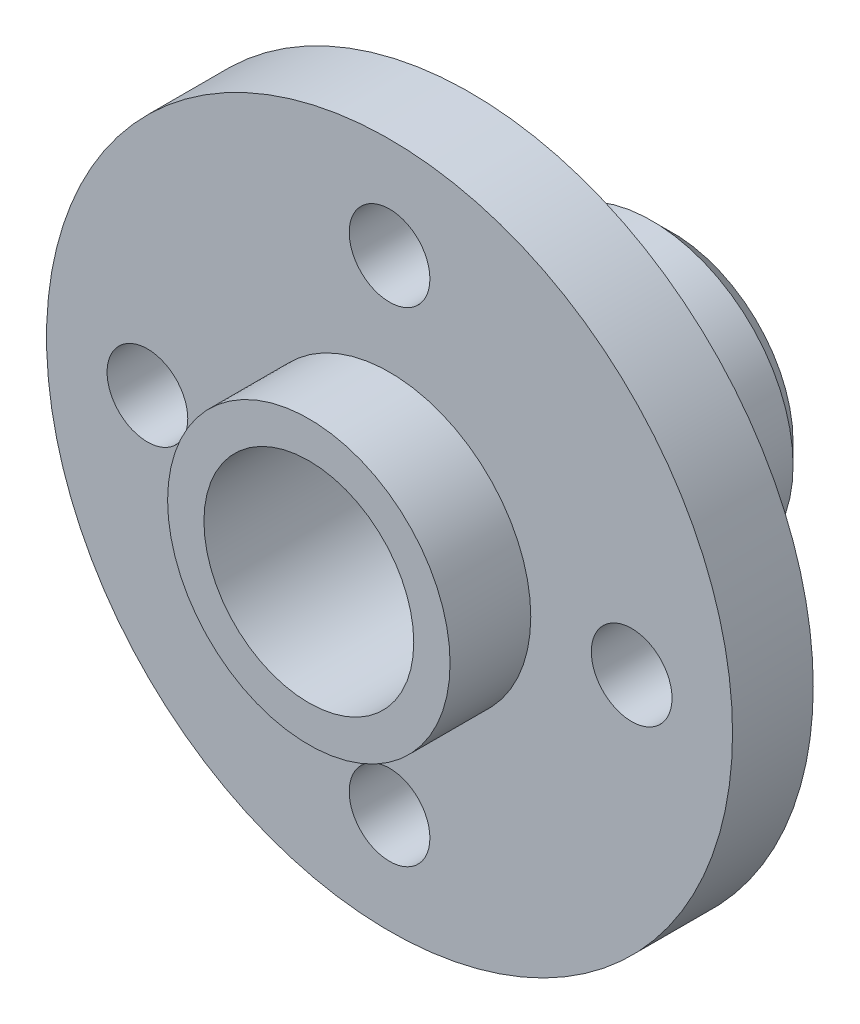
ISO-10303-21;
HEADER;
FILE_DESCRIPTION(('STEP AP214'),'2;1');
FILE_NAME('part.step','',(''),(''),'','','');
FILE_SCHEMA(('AUTOMOTIVE_DESIGN { 1 0 10303 214 1 1 1 1 }'));
ENDSEC;
DATA;
#1=APPLICATION_CONTEXT('core data for automotive mechanical design processes');
#2=APPLICATION_PROTOCOL_DEFINITION('international standard','automotive_design',2000,#1);
#3=PRODUCT_CONTEXT('',#1,'mechanical');
#4=PRODUCT('Part','Part','',(#3));
#5=PRODUCT_RELATED_PRODUCT_CATEGORY('part','',(#4));
#6=PRODUCT_DEFINITION_FORMATION('','',#4);
#7=PRODUCT_DEFINITION_CONTEXT('part definition',#1,'design');
#8=PRODUCT_DEFINITION('design','',#6,#7);
#9=PRODUCT_DEFINITION_SHAPE('','',#8);
#10=(LENGTH_UNIT() NAMED_UNIT(*) SI_UNIT(.MILLI.,.METRE.));
#11=(NAMED_UNIT(*) PLANE_ANGLE_UNIT() SI_UNIT($,.RADIAN.));
#12=(NAMED_UNIT(*) SI_UNIT($,.STERADIAN.) SOLID_ANGLE_UNIT());
#13=UNCERTAINTY_MEASURE_WITH_UNIT(LENGTH_MEASURE(1.E-05),#10,'distance_accuracy_value','');
#14=(GEOMETRIC_REPRESENTATION_CONTEXT(3) GLOBAL_UNCERTAINTY_ASSIGNED_CONTEXT((#13)) GLOBAL_UNIT_ASSIGNED_CONTEXT((#10,
#11,#12)) REPRESENTATION_CONTEXT('',''));
#15=CARTESIAN_POINT('',(0.,0.,0.));
#16=DIRECTION('',(0.,0.,1.));
#17=DIRECTION('',(1.,0.,0.));
#18=AXIS2_PLACEMENT_3D('',#15,#16,#17);
#19=CARTESIAN_POINT('',(0.,0.,0.));
#20=DIRECTION('',(0.,0.,1.));
#21=DIRECTION('',(1.,0.,0.));
#22=AXIS2_PLACEMENT_3D('',#19,#20,#21);
#23=PLANE('',#22);
#24=CARTESIAN_POINT('',(0.,-6.,0.));
#25=DIRECTION('',(0.,0.,1.));
#26=DIRECTION('',(1.,0.,0.));
#27=AXIS2_PLACEMENT_3D('',#24,#25,#26);
#28=CIRCLE('',#27,1.);
#29=CARTESIAN_POINT('',(1.,-6.,0.));
#30=VERTEX_POINT('',#29);
#31=EDGE_CURVE('E77',#30,#30,#28,.T.);
#32=ORIENTED_EDGE('',*,*,#31,.T.);
#33=EDGE_LOOP('',(#32));
#34=FACE_BOUND('',#33,.T.);
#35=CARTESIAN_POINT('',(6.,0.,0.));
#36=DIRECTION('',(0.,0.,1.));
#37=DIRECTION('',(1.,0.,0.));
#38=AXIS2_PLACEMENT_3D('',#35,#36,#37);
#39=CIRCLE('',#38,0.999999999999998);
#40=CARTESIAN_POINT('',(7.,0.,0.));
#41=VERTEX_POINT('',#40);
#42=EDGE_CURVE('E71',#41,#41,#39,.T.);
#43=ORIENTED_EDGE('',*,*,#42,.T.);
#44=EDGE_LOOP('',(#43));
#45=FACE_BOUND('',#44,.T.);
#46=CARTESIAN_POINT('',(0.,6.,0.));
#47=DIRECTION('',(0.,0.,1.));
#48=DIRECTION('',(1.,0.,0.));
#49=AXIS2_PLACEMENT_3D('',#46,#47,#48);
#50=CIRCLE('',#49,1.);
#51=CARTESIAN_POINT('',(0.999999999999999,6.,0.));
#52=VERTEX_POINT('',#51);
#53=EDGE_CURVE('E65',#52,#52,#50,.T.);
#54=ORIENTED_EDGE('',*,*,#53,.T.);
#55=EDGE_LOOP('',(#54));
#56=FACE_BOUND('',#55,.T.);
#57=CARTESIAN_POINT('',(-6.,0.,0.));
#58=DIRECTION('',(0.,0.,1.));
#59=DIRECTION('',(1.,0.,0.));
#60=AXIS2_PLACEMENT_3D('',#57,#58,#59);
#61=CIRCLE('',#60,1.);
#62=CARTESIAN_POINT('',(-5.,0.,0.));
#63=VERTEX_POINT('',#62);
#64=EDGE_CURVE('E59',#63,#63,#61,.T.);
#65=ORIENTED_EDGE('',*,*,#64,.T.);
#66=EDGE_LOOP('',(#65));
#67=FACE_BOUND('',#66,.T.);
#68=CARTESIAN_POINT('',(0.,0.,0.));
#69=DIRECTION('',(0.,0.,1.));
#70=DIRECTION('',(1.,0.,0.));
#71=AXIS2_PLACEMENT_3D('',#68,#69,#70);
#72=CIRCLE('',#71,8.5);
#73=CARTESIAN_POINT('',(8.5,0.,0.));
#74=VERTEX_POINT('',#73);
#75=EDGE_CURVE('E53',#74,#74,#72,.T.);
#76=ORIENTED_EDGE('',*,*,#75,.F.);
#77=EDGE_LOOP('',(#76));
#78=FACE_BOUND('',#77,.T.);
#79=CARTESIAN_POINT('',(0.,0.,0.));
#80=DIRECTION('',(0.,0.,1.));
#81=DIRECTION('',(1.,0.,0.));
#82=AXIS2_PLACEMENT_3D('',#79,#80,#81);
#83=CIRCLE('',#82,3.5);
#84=CARTESIAN_POINT('',(3.5,0.,0.));
#85=VERTEX_POINT('',#84);
#86=EDGE_CURVE('E46',#85,#85,#83,.F.);
#87=ORIENTED_EDGE('',*,*,#86,.F.);
#88=EDGE_LOOP('',(#87));
#89=FACE_BOUND('',#88,.T.);
#90=ADVANCED_FACE('F35',(#34,#45,#56,#67,#78,#89),#23,.F.);
#91=CARTESIAN_POINT('',(0.,0.,2.));
#92=DIRECTION('',(0.,0.,1.));
#93=DIRECTION('',(1.,0.,0.));
#94=AXIS2_PLACEMENT_3D('',#91,#92,#93);
#95=PLANE('',#94);
#96=CARTESIAN_POINT('',(0.,-6.,2.));
#97=DIRECTION('',(0.,0.,1.));
#98=DIRECTION('',(1.,0.,0.));
#99=AXIS2_PLACEMENT_3D('',#96,#97,#98);
#100=CIRCLE('',#99,1.);
#101=CARTESIAN_POINT('',(1.,-6.,2.));
#102=VERTEX_POINT('',#101);
#103=EDGE_CURVE('E74',#102,#102,#100,.T.);
#104=ORIENTED_EDGE('',*,*,#103,.F.);
#105=EDGE_LOOP('',(#104));
#106=FACE_BOUND('',#105,.T.);
#107=CARTESIAN_POINT('',(0.,6.,2.));
#108=DIRECTION('',(0.,0.,1.));
#109=DIRECTION('',(1.,0.,0.));
#110=AXIS2_PLACEMENT_3D('',#107,#108,#109);
#111=CIRCLE('',#110,1.);
#112=CARTESIAN_POINT('',(0.999999999999999,6.,2.));
#113=VERTEX_POINT('',#112);
#114=EDGE_CURVE('E62',#113,#113,#111,.T.);
#115=ORIENTED_EDGE('',*,*,#114,.F.);
#116=EDGE_LOOP('',(#115));
#117=FACE_BOUND('',#116,.T.);
#118=CARTESIAN_POINT('',(0.,0.,2.));
#119=DIRECTION('',(0.,0.,1.));
#120=DIRECTION('',(1.,0.,0.));
#121=AXIS2_PLACEMENT_3D('',#118,#119,#120);
#122=CIRCLE('',#121,8.5);
#123=CARTESIAN_POINT('',(8.5,0.,2.));
#124=VERTEX_POINT('',#123);
#125=EDGE_CURVE('E50',#124,#124,#122,.T.);
#126=ORIENTED_EDGE('',*,*,#125,.T.);
#127=EDGE_LOOP('',(#126));
#128=FACE_BOUND('',#127,.T.);
#129=CARTESIAN_POINT('',(-6.,0.,2.));
#130=DIRECTION('',(0.,0.,1.));
#131=DIRECTION('',(1.,0.,0.));
#132=AXIS2_PLACEMENT_3D('',#129,#130,#131);
#133=CIRCLE('',#132,1.);
#134=CARTESIAN_POINT('',(-5.,0.,2.));
#135=VERTEX_POINT('',#134);
#136=EDGE_CURVE('E56',#135,#135,#133,.T.);
#137=ORIENTED_EDGE('',*,*,#136,.F.);
#138=EDGE_LOOP('',(#137));
#139=FACE_BOUND('',#138,.T.);
#140=CARTESIAN_POINT('',(6.,0.,2.));
#141=DIRECTION('',(0.,0.,1.));
#142=DIRECTION('',(1.,0.,0.));
#143=AXIS2_PLACEMENT_3D('',#140,#141,#142);
#144=CIRCLE('',#143,0.999999999999998);
#145=CARTESIAN_POINT('',(7.,0.,2.));
#146=VERTEX_POINT('',#145);
#147=EDGE_CURVE('E68',#146,#146,#144,.T.);
#148=ORIENTED_EDGE('',*,*,#147,.F.);
#149=EDGE_LOOP('',(#148));
#150=FACE_BOUND('',#149,.T.);
#151=CARTESIAN_POINT('',(0.,0.,2.));
#152=DIRECTION('',(0.,0.,1.));
#153=DIRECTION('',(1.,0.,0.));
#154=AXIS2_PLACEMENT_3D('',#151,#152,#153);
#155=CIRCLE('',#154,3.5);
#156=CARTESIAN_POINT('',(3.5,0.,2.));
#157=VERTEX_POINT('',#156);
#158=EDGE_CURVE('E83',#157,#157,#155,.T.);
#159=ORIENTED_EDGE('',*,*,#158,.F.);
#160=EDGE_LOOP('',(#159));
#161=FACE_BOUND('',#160,.T.);
#162=ADVANCED_FACE('F111',(#106,#117,#128,#139,#150,#161),#95,.T.);
#163=CARTESIAN_POINT('',(0.,0.,2.));
#164=DIRECTION('',(0.,0.,-1.));
#165=DIRECTION('',(-1.,0.,0.));
#166=AXIS2_PLACEMENT_3D('',#163,#164,#165);
#167=CYLINDRICAL_SURFACE('',#166,8.5);
#168=ORIENTED_EDGE('',*,*,#125,.F.);
#169=EDGE_LOOP('',(#168));
#170=FACE_BOUND('',#169,.T.);
#171=ORIENTED_EDGE('',*,*,#75,.T.);
#172=EDGE_LOOP('',(#171));
#173=FACE_BOUND('',#172,.T.);
#174=ADVANCED_FACE('F117',(#170,#173),#167,.T.);
#175=CARTESIAN_POINT('',(0.,0.,2.));
#176=DIRECTION('',(0.,0.,-1.));
#177=DIRECTION('',(-1.,0.,0.));
#178=AXIS2_PLACEMENT_3D('',#175,#176,#177);
#179=CYLINDRICAL_SURFACE('',#178,2.6);
#180=CARTESIAN_POINT('',(0.,0.,4.));
#181=DIRECTION('',(0.,0.,1.));
#182=DIRECTION('',(1.,0.,0.));
#183=AXIS2_PLACEMENT_3D('',#180,#181,#182);
#184=CIRCLE('',#183,2.6);
#185=CARTESIAN_POINT('',(2.6,0.,4.));
#186=VERTEX_POINT('',#185);
#187=EDGE_CURVE('E86',#186,#186,#184,.T.);
#188=ORIENTED_EDGE('',*,*,#187,.T.);
#189=EDGE_LOOP('',(#188));
#190=FACE_BOUND('',#189,.T.);
#191=CARTESIAN_POINT('',(0.,0.,-5.));
#192=DIRECTION('',(0.,0.,-1.));
#193=DIRECTION('',(-1.,0.,0.));
#194=AXIS2_PLACEMENT_3D('',#191,#192,#193);
#195=CIRCLE('',#194,2.6);
#196=CARTESIAN_POINT('',(-2.6,0.,-5.));
#197=VERTEX_POINT('',#196);
#198=EDGE_CURVE('E91',#197,#197,#195,.T.);
#199=ORIENTED_EDGE('',*,*,#198,.T.);
#200=EDGE_LOOP('',(#199));
#201=FACE_BOUND('',#200,.T.);
#202=ADVANCED_FACE('F95',(#190,#201),#179,.F.);
#203=CARTESIAN_POINT('',(-6.,0.,2.));
#204=DIRECTION('',(0.,0.,-1.));
#205=DIRECTION('',(-1.,0.,0.));
#206=AXIS2_PLACEMENT_3D('',#203,#204,#205);
#207=CYLINDRICAL_SURFACE('',#206,1.);
#208=ORIENTED_EDGE('',*,*,#136,.T.);
#209=EDGE_LOOP('',(#208));
#210=FACE_BOUND('',#209,.T.);
#211=ORIENTED_EDGE('',*,*,#64,.F.);
#212=EDGE_LOOP('',(#211));
#213=FACE_BOUND('',#212,.T.);
#214=ADVANCED_FACE('F127',(#210,#213),#207,.F.);
#215=CARTESIAN_POINT('',(0.,6.,2.));
#216=DIRECTION('',(0.,0.,-1.));
#217=DIRECTION('',(-1.,0.,0.));
#218=AXIS2_PLACEMENT_3D('',#215,#216,#217);
#219=CYLINDRICAL_SURFACE('',#218,1.);
#220=ORIENTED_EDGE('',*,*,#114,.T.);
#221=EDGE_LOOP('',(#220));
#222=FACE_BOUND('',#221,.T.);
#223=ORIENTED_EDGE('',*,*,#53,.F.);
#224=EDGE_LOOP('',(#223));
#225=FACE_BOUND('',#224,.T.);
#226=ADVANCED_FACE('F149',(#222,#225),#219,.F.);
#227=CARTESIAN_POINT('',(6.,0.,2.));
#228=DIRECTION('',(0.,0.,-1.));
#229=DIRECTION('',(-1.,0.,0.));
#230=AXIS2_PLACEMENT_3D('',#227,#228,#229);
#231=CYLINDRICAL_SURFACE('',#230,0.999999999999998);
#232=ORIENTED_EDGE('',*,*,#147,.T.);
#233=EDGE_LOOP('',(#232));
#234=FACE_BOUND('',#233,.T.);
#235=ORIENTED_EDGE('',*,*,#42,.F.);
#236=EDGE_LOOP('',(#235));
#237=FACE_BOUND('',#236,.T.);
#238=ADVANCED_FACE('F145',(#234,#237),#231,.F.);
#239=CARTESIAN_POINT('',(0.,-6.,2.));
#240=DIRECTION('',(0.,0.,-1.));
#241=DIRECTION('',(-1.,0.,0.));
#242=AXIS2_PLACEMENT_3D('',#239,#240,#241);
#243=CYLINDRICAL_SURFACE('',#242,1.);
#244=ORIENTED_EDGE('',*,*,#103,.T.);
#245=EDGE_LOOP('',(#244));
#246=FACE_BOUND('',#245,.T.);
#247=ORIENTED_EDGE('',*,*,#31,.F.);
#248=EDGE_LOOP('',(#247));
#249=FACE_BOUND('',#248,.T.);
#250=ADVANCED_FACE('F148',(#246,#249),#243,.F.);
#251=CARTESIAN_POINT('',(0.,0.,4.));
#252=DIRECTION('',(0.,0.,1.));
#253=DIRECTION('',(1.,0.,0.));
#254=AXIS2_PLACEMENT_3D('',#251,#252,#253);
#255=PLANE('',#254);
#256=CARTESIAN_POINT('',(0.,0.,4.));
#257=DIRECTION('',(0.,0.,1.));
#258=DIRECTION('',(1.,0.,0.));
#259=AXIS2_PLACEMENT_3D('',#256,#257,#258);
#260=CIRCLE('',#259,3.5);
#261=CARTESIAN_POINT('',(3.5,0.,4.));
#262=VERTEX_POINT('',#261);
#263=EDGE_CURVE('E80',#262,#262,#260,.T.);
#264=ORIENTED_EDGE('',*,*,#263,.T.);
#265=EDGE_LOOP('',(#264));
#266=FACE_BOUND('',#265,.T.);
#267=ORIENTED_EDGE('',*,*,#187,.F.);
#268=EDGE_LOOP('',(#267));
#269=FACE_BOUND('',#268,.T.);
#270=ADVANCED_FACE('F107',(#266,#269),#255,.T.);
#271=CARTESIAN_POINT('',(0.,0.,4.));
#272=DIRECTION('',(0.,0.,-1.));
#273=DIRECTION('',(-1.,0.,0.));
#274=AXIS2_PLACEMENT_3D('',#271,#272,#273);
#275=CYLINDRICAL_SURFACE('',#274,3.5);
#276=ORIENTED_EDGE('',*,*,#263,.F.);
#277=EDGE_LOOP('',(#276));
#278=FACE_BOUND('',#277,.T.);
#279=ORIENTED_EDGE('',*,*,#158,.T.);
#280=EDGE_LOOP('',(#279));
#281=FACE_BOUND('',#280,.T.);
#282=ADVANCED_FACE('F100',(#278,#281),#275,.T.);
#283=CARTESIAN_POINT('',(0.,0.,-5.));
#284=DIRECTION('',(0.,0.,-1.));
#285=DIRECTION('',(-1.,0.,0.));
#286=AXIS2_PLACEMENT_3D('',#283,#284,#285);
#287=PLANE('',#286);
#288=CARTESIAN_POINT('',(0.,0.,-5.));
#289=DIRECTION('',(0.,0.,-1.));
#290=DIRECTION('',(-1.,0.,0.));
#291=AXIS2_PLACEMENT_3D('',#288,#289,#290);
#292=CIRCLE('',#291,3.);
#293=CARTESIAN_POINT('',(-3.,0.,-5.));
#294=VERTEX_POINT('',#293);
#295=EDGE_CURVE('E42',#294,#294,#292,.T.);
#296=ORIENTED_EDGE('',*,*,#295,.T.);
#297=EDGE_LOOP('',(#296));
#298=FACE_BOUND('',#297,.T.);
#299=ORIENTED_EDGE('',*,*,#198,.F.);
#300=EDGE_LOOP('',(#299));
#301=FACE_BOUND('',#300,.T.);
#302=ADVANCED_FACE('F97',(#298,#301),#287,.T.);
#303=CARTESIAN_POINT('',(0.,0.,-5.));
#304=DIRECTION('',(0.,0.,1.));
#305=DIRECTION('',(1.,0.,0.));
#306=AXIS2_PLACEMENT_3D('',#303,#304,#305);
#307=CYLINDRICAL_SURFACE('',#306,3.5);
#308=CARTESIAN_POINT('',(0.,0.,-4.5));
#309=DIRECTION('',(0.,0.,-1.));
#310=DIRECTION('',(-1.,0.,0.));
#311=AXIS2_PLACEMENT_3D('',#308,#309,#310);
#312=CIRCLE('',#311,3.5);
#313=CARTESIAN_POINT('',(-3.5,0.,-4.5));
#314=VERTEX_POINT('',#313);
#315=EDGE_CURVE('E10',#314,#314,#312,.F.);
#316=ORIENTED_EDGE('',*,*,#315,.T.);
#317=EDGE_LOOP('',(#316));
#318=FACE_BOUND('',#317,.T.);
#319=ORIENTED_EDGE('',*,*,#86,.T.);
#320=EDGE_LOOP('',(#319));
#321=FACE_BOUND('',#320,.T.);
#322=ADVANCED_FACE('F99',(#318,#321),#307,.T.);
#323=CARTESIAN_POINT('',(0.,0.,-5.));
#324=DIRECTION('',(0.,0.,1.));
#325=DIRECTION('',(1.,0.,0.));
#326=AXIS2_PLACEMENT_3D('',#323,#324,#325);
#327=CONICAL_SURFACE('',#326,3.,0.785398163397447);
#328=ORIENTED_EDGE('',*,*,#315,.F.);
#329=EDGE_LOOP('',(#328));
#330=FACE_BOUND('',#329,.T.);
#331=ORIENTED_EDGE('',*,*,#295,.F.);
#332=EDGE_LOOP('',(#331));
#333=FACE_BOUND('',#332,.T.);
#334=ADVANCED_FACE('F37',(#330,#333),#327,.T.);
#335=CLOSED_SHELL('',(#90,#162,#174,#202,#214,#226,#238,#250,#270,#282,#302,#322,#334));
#336=MANIFOLD_SOLID_BREP('B2',#335);
#337=ADVANCED_BREP_SHAPE_REPRESENTATION('',(#18,#336),#14);
#338=SHAPE_DEFINITION_REPRESENTATION(#9,#337);
ENDSEC;
END-ISO-10303-21;
